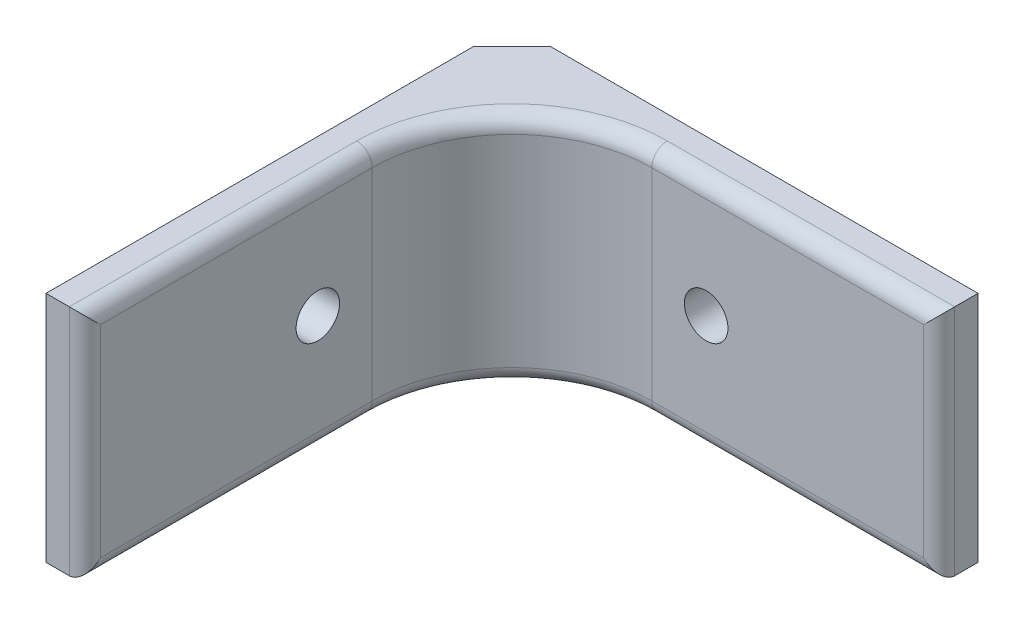
ISO-10303-21;
HEADER;
FILE_DESCRIPTION(('STEP AP214'),'2;1');
FILE_NAME('part.step','',(''),(''),'','','');
FILE_SCHEMA(('AUTOMOTIVE_DESIGN { 1 0 10303 214 1 1 1 1 }'));
ENDSEC;
DATA;
#1=APPLICATION_CONTEXT('core data for automotive mechanical design processes');
#2=APPLICATION_PROTOCOL_DEFINITION('international standard','automotive_design',2000,#1);
#3=PRODUCT_CONTEXT('',#1,'mechanical');
#4=PRODUCT('Part','Part','',(#3));
#5=PRODUCT_RELATED_PRODUCT_CATEGORY('part','',(#4));
#6=PRODUCT_DEFINITION_FORMATION('','',#4);
#7=PRODUCT_DEFINITION_CONTEXT('part definition',#1,'design');
#8=PRODUCT_DEFINITION('design','',#6,#7);
#9=PRODUCT_DEFINITION_SHAPE('','',#8);
#10=(LENGTH_UNIT() NAMED_UNIT(*) SI_UNIT(.MILLI.,.METRE.));
#11=(NAMED_UNIT(*) PLANE_ANGLE_UNIT() SI_UNIT($,.RADIAN.));
#12=(NAMED_UNIT(*) SI_UNIT($,.STERADIAN.) SOLID_ANGLE_UNIT());
#13=UNCERTAINTY_MEASURE_WITH_UNIT(LENGTH_MEASURE(1.E-05),#10,'distance_accuracy_value','');
#14=(GEOMETRIC_REPRESENTATION_CONTEXT(3) GLOBAL_UNCERTAINTY_ASSIGNED_CONTEXT((#13)) GLOBAL_UNIT_ASSIGNED_CONTEXT((#10,
#11,#12)) REPRESENTATION_CONTEXT('',''));
#15=CARTESIAN_POINT('',(0.,0.,0.));
#16=DIRECTION('',(0.,0.,1.));
#17=DIRECTION('',(1.,0.,0.));
#18=AXIS2_PLACEMENT_3D('',#15,#16,#17);
#19=CARTESIAN_POINT('',(0.,38.1,0.));
#20=DIRECTION('',(0.,0.,1.));
#21=DIRECTION('',(1.,0.,0.));
#22=AXIS2_PLACEMENT_3D('',#19,#20,#21);
#23=PLANE('',#22);
#24=CARTESIAN_POINT('',(38.1,19.05,0.));
#25=DIRECTION('',(0.,0.,1.));
#26=DIRECTION('',(1.,0.,0.));
#27=AXIS2_PLACEMENT_3D('',#24,#25,#26);
#28=CIRCLE('',#27,3.556);
#29=CARTESIAN_POINT('',(41.656,19.05,0.));
#30=VERTEX_POINT('',#29);
#31=EDGE_CURVE('E279',#30,#30,#28,.T.);
#32=ORIENTED_EDGE('',*,*,#31,.T.);
#33=EDGE_LOOP('',(#32));
#34=FACE_BOUND('',#33,.T.);
#35=DIRECTION('',(-1.,0.,0.));
#36=VECTOR('',#35,1.);
#37=CARTESIAN_POINT('',(0.,0.,0.));
#38=LINE('',#37,#36);
#39=CARTESIAN_POINT('',(76.2,0.,0.));
#40=VERTEX_POINT('',#39);
#41=CARTESIAN_POINT('',(6.35000000000004,0.,0.));
#42=VERTEX_POINT('',#41);
#43=EDGE_CURVE('E165',#40,#42,#38,.T.);
#44=ORIENTED_EDGE('',*,*,#43,.T.);
#45=DIRECTION('',(0.,1.,0.));
#46=VECTOR('',#45,1.);
#47=CARTESIAN_POINT('',(6.35000000000004,38.1,0.));
#48=LINE('',#47,#46);
#49=CARTESIAN_POINT('',(6.35000000000004,38.1,0.));
#50=VERTEX_POINT('',#49);
#51=EDGE_CURVE('E54',#42,#50,#48,.T.);
#52=ORIENTED_EDGE('',*,*,#51,.T.);
#53=DIRECTION('',(-1.,0.,0.));
#54=VECTOR('',#53,1.);
#55=CARTESIAN_POINT('',(0.,38.1,0.));
#56=LINE('',#55,#54);
#57=CARTESIAN_POINT('',(76.2,38.1,0.));
#58=VERTEX_POINT('',#57);
#59=EDGE_CURVE('E145',#58,#50,#56,.T.);
#60=ORIENTED_EDGE('',*,*,#59,.F.);
#61=DIRECTION('',(0.,-1.,0.));
#62=VECTOR('',#61,1.);
#63=CARTESIAN_POINT('',(76.2,38.1,0.));
#64=LINE('',#63,#62);
#65=EDGE_CURVE('E155',#58,#40,#64,.T.);
#66=ORIENTED_EDGE('',*,*,#65,.T.);
#67=EDGE_LOOP('',(#44,#52,#60,#66));
#68=FACE_BOUND('',#67,.T.);
#69=ADVANCED_FACE('F45',(#34,#68),#23,.F.);
#70=CARTESIAN_POINT('',(0.,38.1,0.));
#71=DIRECTION('',(1.,0.,0.));
#72=DIRECTION('',(0.,0.,-1.));
#73=AXIS2_PLACEMENT_3D('',#70,#71,#72);
#74=PLANE('',#73);
#75=CARTESIAN_POINT('',(0.,19.05,38.1));
#76=DIRECTION('',(1.,0.,0.));
#77=DIRECTION('',(0.,0.,-1.));
#78=AXIS2_PLACEMENT_3D('',#75,#76,#77);
#79=CIRCLE('',#78,3.556);
#80=CARTESIAN_POINT('',(0.,19.05,34.544));
#81=VERTEX_POINT('',#80);
#82=EDGE_CURVE('E167',#81,#81,#79,.T.);
#83=ORIENTED_EDGE('',*,*,#82,.T.);
#84=EDGE_LOOP('',(#83));
#85=FACE_BOUND('',#84,.T.);
#86=DIRECTION('',(0.,0.,1.));
#87=VECTOR('',#86,1.);
#88=CARTESIAN_POINT('',(0.,38.1,0.));
#89=LINE('',#88,#87);
#90=CARTESIAN_POINT('',(0.,38.1,6.35000000000001));
#91=VERTEX_POINT('',#90);
#92=CARTESIAN_POINT('',(0.,38.1,76.2));
#93=VERTEX_POINT('',#92);
#94=EDGE_CURVE('E135',#91,#93,#89,.T.);
#95=ORIENTED_EDGE('',*,*,#94,.F.);
#96=DIRECTION('',(0.,-1.,0.));
#97=VECTOR('',#96,1.);
#98=CARTESIAN_POINT('',(0.,38.1,6.35000000000001));
#99=LINE('',#98,#97);
#100=CARTESIAN_POINT('',(0.,0.,6.35000000000001));
#101=VERTEX_POINT('',#100);
#102=EDGE_CURVE('E213',#91,#101,#99,.T.);
#103=ORIENTED_EDGE('',*,*,#102,.T.);
#104=DIRECTION('',(0.,0.,1.));
#105=VECTOR('',#104,1.);
#106=CARTESIAN_POINT('',(0.,0.,0.));
#107=LINE('',#106,#105);
#108=CARTESIAN_POINT('',(0.,0.,76.2));
#109=VERTEX_POINT('',#108);
#110=EDGE_CURVE('E150',#101,#109,#107,.T.);
#111=ORIENTED_EDGE('',*,*,#110,.T.);
#112=DIRECTION('',(0.,-1.,0.));
#113=VECTOR('',#112,1.);
#114=CARTESIAN_POINT('',(0.,38.1,76.2));
#115=LINE('',#114,#113);
#116=EDGE_CURVE('E148',#93,#109,#115,.T.);
#117=ORIENTED_EDGE('',*,*,#116,.F.);
#118=EDGE_LOOP('',(#95,#103,#111,#117));
#119=FACE_BOUND('',#118,.T.);
#120=ADVANCED_FACE('F149',(#85,#119),#74,.F.);
#121=CARTESIAN_POINT('',(0.,38.1,76.2));
#122=DIRECTION('',(0.,0.,-1.));
#123=DIRECTION('',(-1.,0.,0.));
#124=AXIS2_PLACEMENT_3D('',#121,#122,#123);
#125=PLANE('',#124);
#126=DIRECTION('',(1.,0.,0.));
#127=VECTOR('',#126,1.);
#128=CARTESIAN_POINT('',(0.,0.,76.2));
#129=LINE('',#128,#127);
#130=CARTESIAN_POINT('',(3.81,0.,76.2));
#131=VERTEX_POINT('',#130);
#132=EDGE_CURVE('E169',#109,#131,#129,.T.);
#133=ORIENTED_EDGE('',*,*,#132,.T.);
#134=DIRECTION('',(0.,-1.,0.));
#135=VECTOR('',#134,1.);
#136=CARTESIAN_POINT('',(3.81,38.1,76.2));
#137=LINE('',#136,#135);
#138=CARTESIAN_POINT('',(3.81,38.1,76.2));
#139=VERTEX_POINT('',#138);
#140=EDGE_CURVE('E159',#131,#139,#137,.F.);
#141=ORIENTED_EDGE('',*,*,#140,.T.);
#142=DIRECTION('',(1.,0.,0.));
#143=VECTOR('',#142,1.);
#144=CARTESIAN_POINT('',(0.,38.1,76.2));
#145=LINE('',#144,#143);
#146=EDGE_CURVE('E139',#93,#139,#145,.T.);
#147=ORIENTED_EDGE('',*,*,#146,.F.);
#148=ORIENTED_EDGE('',*,*,#116,.T.);
#149=EDGE_LOOP('',(#133,#141,#147,#148));
#150=FACE_BOUND('',#149,.T.);
#151=ADVANCED_FACE('F157',(#150),#125,.F.);
#152=CARTESIAN_POINT('',(6.35,38.1,6.35));
#153=DIRECTION('',(-1.,0.,0.));
#154=DIRECTION('',(0.,0.,1.));
#155=AXIS2_PLACEMENT_3D('',#152,#153,#154);
#156=PLANE('',#155);
#157=CARTESIAN_POINT('',(6.35,19.05,38.1));
#158=DIRECTION('',(1.,0.,0.));
#159=DIRECTION('',(0.,0.,-1.));
#160=AXIS2_PLACEMENT_3D('',#157,#158,#159);
#161=CIRCLE('',#160,3.556);
#162=CARTESIAN_POINT('',(6.35,19.05,34.544));
#163=VERTEX_POINT('',#162);
#164=EDGE_CURVE('E276',#163,#163,#161,.T.);
#165=ORIENTED_EDGE('',*,*,#164,.F.);
#166=EDGE_LOOP('',(#165));
#167=FACE_BOUND('',#166,.T.);
#168=DIRECTION('',(0.,-1.,0.));
#169=VECTOR('',#168,1.);
#170=CARTESIAN_POINT('',(6.35,38.1,73.66));
#171=LINE('',#170,#169);
#172=CARTESIAN_POINT('',(6.35,35.56,73.66));
#173=VERTEX_POINT('',#172);
#174=CARTESIAN_POINT('',(6.35,2.54,73.66));
#175=VERTEX_POINT('',#174);
#176=EDGE_CURVE('E196',#173,#175,#171,.T.);
#177=ORIENTED_EDGE('',*,*,#176,.T.);
#178=DIRECTION('',(0.,0.,-1.));
#179=VECTOR('',#178,1.);
#180=CARTESIAN_POINT('',(6.35,2.54,29.21));
#181=LINE('',#180,#179);
#182=CARTESIAN_POINT('',(6.35,2.54,29.21));
#183=VERTEX_POINT('',#182);
#184=EDGE_CURVE('E198',#175,#183,#181,.T.);
#185=ORIENTED_EDGE('',*,*,#184,.T.);
#186=DIRECTION('',(0.,-1.,0.));
#187=VECTOR('',#186,1.);
#188=CARTESIAN_POINT('',(6.35,38.1,29.21));
#189=LINE('',#188,#187);
#190=CARTESIAN_POINT('',(6.35,35.56,29.21));
#191=VERTEX_POINT('',#190);
#192=EDGE_CURVE('E177',#183,#191,#189,.F.);
#193=ORIENTED_EDGE('',*,*,#192,.T.);
#194=DIRECTION('',(0.,0.,-1.));
#195=VECTOR('',#194,1.);
#196=CARTESIAN_POINT('',(6.35,35.56,6.35));
#197=LINE('',#196,#195);
#198=EDGE_CURVE('E194',#191,#173,#197,.F.);
#199=ORIENTED_EDGE('',*,*,#198,.T.);
#200=EDGE_LOOP('',(#177,#185,#193,#199));
#201=FACE_BOUND('',#200,.T.);
#202=ADVANCED_FACE('F253',(#167,#201),#156,.F.);
#203=CARTESIAN_POINT('',(6.35,38.1,6.35));
#204=DIRECTION('',(0.,0.,-1.));
#205=DIRECTION('',(-1.,0.,0.));
#206=AXIS2_PLACEMENT_3D('',#203,#204,#205);
#207=PLANE('',#206);
#208=DIRECTION('',(0.,-1.,0.));
#209=VECTOR('',#208,1.);
#210=CARTESIAN_POINT('',(29.21,0.,6.35));
#211=LINE('',#210,#209);
#212=CARTESIAN_POINT('',(29.21,35.56,6.35));
#213=VERTEX_POINT('',#212);
#214=CARTESIAN_POINT('',(29.21,2.54,6.35));
#215=VERTEX_POINT('',#214);
#216=EDGE_CURVE('E154',#213,#215,#211,.T.);
#217=ORIENTED_EDGE('',*,*,#216,.T.);
#218=DIRECTION('',(1.,0.,0.));
#219=VECTOR('',#218,1.);
#220=CARTESIAN_POINT('',(76.2,2.54,6.35));
#221=LINE('',#220,#219);
#222=CARTESIAN_POINT('',(73.66,2.54,6.35));
#223=VERTEX_POINT('',#222);
#224=EDGE_CURVE('E184',#215,#223,#221,.T.);
#225=ORIENTED_EDGE('',*,*,#224,.T.);
#226=DIRECTION('',(0.,-1.,0.));
#227=VECTOR('',#226,1.);
#228=CARTESIAN_POINT('',(73.66,38.1,6.35));
#229=LINE('',#228,#227);
#230=CARTESIAN_POINT('',(73.66,35.56,6.35));
#231=VERTEX_POINT('',#230);
#232=EDGE_CURVE('E180',#223,#231,#229,.F.);
#233=ORIENTED_EDGE('',*,*,#232,.T.);
#234=DIRECTION('',(1.,0.,0.));
#235=VECTOR('',#234,1.);
#236=CARTESIAN_POINT('',(6.35,35.56,6.35));
#237=LINE('',#236,#235);
#238=EDGE_CURVE('E182',#231,#213,#237,.F.);
#239=ORIENTED_EDGE('',*,*,#238,.T.);
#240=EDGE_LOOP('',(#217,#225,#233,#239));
#241=FACE_BOUND('',#240,.T.);
#242=CARTESIAN_POINT('',(38.1,19.05,6.35));
#243=DIRECTION('',(0.,0.,1.));
#244=DIRECTION('',(1.,0.,0.));
#245=AXIS2_PLACEMENT_3D('',#242,#243,#244);
#246=CIRCLE('',#245,3.556);
#247=CARTESIAN_POINT('',(41.656,19.05,6.35));
#248=VERTEX_POINT('',#247);
#249=EDGE_CURVE('E236',#248,#248,#246,.T.);
#250=ORIENTED_EDGE('',*,*,#249,.F.);
#251=EDGE_LOOP('',(#250));
#252=FACE_BOUND('',#251,.T.);
#253=ADVANCED_FACE('F295',(#241,#252),#207,.F.);
#254=CARTESIAN_POINT('',(76.2,38.1,0.));
#255=DIRECTION('',(-1.,0.,0.));
#256=DIRECTION('',(0.,0.,1.));
#257=AXIS2_PLACEMENT_3D('',#254,#255,#256);
#258=PLANE('',#257);
#259=DIRECTION('',(0.,0.,-1.));
#260=VECTOR('',#259,1.);
#261=CARTESIAN_POINT('',(76.2,38.1,0.));
#262=LINE('',#261,#260);
#263=CARTESIAN_POINT('',(76.2,38.1,3.81));
#264=VERTEX_POINT('',#263);
#265=EDGE_CURVE('E160',#264,#58,#262,.T.);
#266=ORIENTED_EDGE('',*,*,#265,.F.);
#267=DIRECTION('',(0.,-1.,0.));
#268=VECTOR('',#267,1.);
#269=CARTESIAN_POINT('',(76.2,38.1,3.81));
#270=LINE('',#269,#268);
#271=CARTESIAN_POINT('',(76.2,0.,3.81));
#272=VERTEX_POINT('',#271);
#273=EDGE_CURVE('E210',#264,#272,#270,.T.);
#274=ORIENTED_EDGE('',*,*,#273,.T.);
#275=DIRECTION('',(0.,0.,-1.));
#276=VECTOR('',#275,1.);
#277=CARTESIAN_POINT('',(76.2,0.,0.));
#278=LINE('',#277,#276);
#279=EDGE_CURVE('E171',#272,#40,#278,.T.);
#280=ORIENTED_EDGE('',*,*,#279,.T.);
#281=ORIENTED_EDGE('',*,*,#65,.F.);
#282=EDGE_LOOP('',(#266,#274,#280,#281));
#283=FACE_BOUND('',#282,.T.);
#284=ADVANCED_FACE('F273',(#283),#258,.F.);
#285=CARTESIAN_POINT('',(0.,38.1,0.));
#286=DIRECTION('',(0.,-1.,0.));
#287=DIRECTION('',(0.,0.,-1.));
#288=AXIS2_PLACEMENT_3D('',#285,#286,#287);
#289=PLANE('',#288);
#290=ORIENTED_EDGE('',*,*,#59,.T.);
#291=DIRECTION('',(0.707106781186549,0.,-0.707106781186546));
#292=VECTOR('',#291,1.);
#293=CARTESIAN_POINT('',(0.,38.1,6.35000000000001));
#294=LINE('',#293,#292);
#295=EDGE_CURVE('E11',#50,#91,#294,.F.);
#296=ORIENTED_EDGE('',*,*,#295,.T.);
#297=ORIENTED_EDGE('',*,*,#94,.T.);
#298=ORIENTED_EDGE('',*,*,#146,.T.);
#299=DIRECTION('',(0.,0.,-1.));
#300=VECTOR('',#299,1.);
#301=CARTESIAN_POINT('',(3.81,38.1,0.));
#302=LINE('',#301,#300);
#303=CARTESIAN_POINT('',(3.81,38.1,29.21));
#304=VERTEX_POINT('',#303);
#305=EDGE_CURVE('E200',#139,#304,#302,.T.);
#306=ORIENTED_EDGE('',*,*,#305,.T.);
#307=CARTESIAN_POINT('',(29.21,38.1,29.21));
#308=DIRECTION('',(0.,-1.,0.));
#309=DIRECTION('',(0.,0.,-1.));
#310=AXIS2_PLACEMENT_3D('',#307,#308,#309);
#311=CIRCLE('',#310,25.4);
#312=CARTESIAN_POINT('',(29.21,38.1,3.80999999999999));
#313=VERTEX_POINT('',#312);
#314=EDGE_CURVE('E202',#304,#313,#311,.T.);
#315=ORIENTED_EDGE('',*,*,#314,.T.);
#316=DIRECTION('',(1.,0.,0.));
#317=VECTOR('',#316,1.);
#318=CARTESIAN_POINT('',(0.,38.1,3.81));
#319=LINE('',#318,#317);
#320=EDGE_CURVE('E204',#313,#264,#319,.T.);
#321=ORIENTED_EDGE('',*,*,#320,.T.);
#322=ORIENTED_EDGE('',*,*,#265,.T.);
#323=EDGE_LOOP('',(#290,#296,#297,#298,#306,#315,#321,#322));
#324=FACE_BOUND('',#323,.T.);
#325=ADVANCED_FACE('F137',(#324),#289,.F.);
#326=CARTESIAN_POINT('',(0.,0.,0.));
#327=DIRECTION('',(0.,-1.,0.));
#328=DIRECTION('',(0.,0.,-1.));
#329=AXIS2_PLACEMENT_3D('',#326,#327,#328);
#330=PLANE('',#329);
#331=ORIENTED_EDGE('',*,*,#110,.F.);
#332=DIRECTION('',(-0.707106781186549,0.,0.707106781186546));
#333=VECTOR('',#332,1.);
#334=CARTESIAN_POINT('',(3.17500000000001,0.,3.17500000000002));
#335=LINE('',#334,#333);
#336=EDGE_CURVE('E68',#101,#42,#335,.F.);
#337=ORIENTED_EDGE('',*,*,#336,.T.);
#338=ORIENTED_EDGE('',*,*,#43,.F.);
#339=ORIENTED_EDGE('',*,*,#279,.F.);
#340=DIRECTION('',(1.,0.,0.));
#341=VECTOR('',#340,1.);
#342=CARTESIAN_POINT('',(29.21,0.,3.81));
#343=LINE('',#342,#341);
#344=CARTESIAN_POINT('',(29.21,0.,3.80999999999999));
#345=VERTEX_POINT('',#344);
#346=EDGE_CURVE('E191',#272,#345,#343,.F.);
#347=ORIENTED_EDGE('',*,*,#346,.T.);
#348=CARTESIAN_POINT('',(29.21,0.,29.21));
#349=DIRECTION('',(0.,-1.,0.));
#350=DIRECTION('',(0.,0.,-1.));
#351=AXIS2_PLACEMENT_3D('',#348,#349,#350);
#352=CIRCLE('',#351,25.4);
#353=CARTESIAN_POINT('',(3.80999999999999,0.,29.21));
#354=VERTEX_POINT('',#353);
#355=EDGE_CURVE('E187',#345,#354,#352,.F.);
#356=ORIENTED_EDGE('',*,*,#355,.T.);
#357=DIRECTION('',(0.,0.,-1.));
#358=VECTOR('',#357,1.);
#359=CARTESIAN_POINT('',(3.81,0.,76.2));
#360=LINE('',#359,#358);
#361=EDGE_CURVE('E189',#354,#131,#360,.F.);
#362=ORIENTED_EDGE('',*,*,#361,.T.);
#363=ORIENTED_EDGE('',*,*,#132,.F.);
#364=EDGE_LOOP('',(#331,#337,#338,#339,#347,#356,#362,#363));
#365=FACE_BOUND('',#364,.T.);
#366=ADVANCED_FACE('F239',(#365),#330,.T.);
#367=CARTESIAN_POINT('',(0.,19.05,38.1));
#368=DIRECTION('',(1.,0.,0.));
#369=DIRECTION('',(0.,0.,-1.));
#370=AXIS2_PLACEMENT_3D('',#367,#368,#369);
#371=CYLINDRICAL_SURFACE('',#370,3.556);
#372=ORIENTED_EDGE('',*,*,#82,.F.);
#373=EDGE_LOOP('',(#372));
#374=FACE_BOUND('',#373,.T.);
#375=ORIENTED_EDGE('',*,*,#164,.T.);
#376=EDGE_LOOP('',(#375));
#377=FACE_BOUND('',#376,.T.);
#378=ADVANCED_FACE('F291',(#374,#377),#371,.F.);
#379=CARTESIAN_POINT('',(38.1,19.05,0.));
#380=DIRECTION('',(0.,0.,1.));
#381=DIRECTION('',(1.,0.,0.));
#382=AXIS2_PLACEMENT_3D('',#379,#380,#381);
#383=CYLINDRICAL_SURFACE('',#382,3.556);
#384=ORIENTED_EDGE('',*,*,#31,.F.);
#385=EDGE_LOOP('',(#384));
#386=FACE_BOUND('',#385,.T.);
#387=ORIENTED_EDGE('',*,*,#249,.T.);
#388=EDGE_LOOP('',(#387));
#389=FACE_BOUND('',#388,.T.);
#390=ADVANCED_FACE('F288',(#386,#389),#383,.F.);
#391=CARTESIAN_POINT('',(29.21,38.1,29.21));
#392=DIRECTION('',(0.,1.,0.));
#393=DIRECTION('',(0.,0.,1.));
#394=AXIS2_PLACEMENT_3D('',#391,#392,#393);
#395=CYLINDRICAL_SURFACE('',#394,22.86);
#396=ORIENTED_EDGE('',*,*,#216,.F.);
#397=CARTESIAN_POINT('',(29.21,35.56,29.21));
#398=DIRECTION('',(0.,-1.,0.));
#399=DIRECTION('',(0.,0.,-1.));
#400=AXIS2_PLACEMENT_3D('',#397,#398,#399);
#401=CIRCLE('',#400,22.86);
#402=EDGE_CURVE('E208',#213,#191,#401,.F.);
#403=ORIENTED_EDGE('',*,*,#402,.T.);
#404=ORIENTED_EDGE('',*,*,#192,.F.);
#405=CARTESIAN_POINT('',(29.21,2.54,29.21));
#406=DIRECTION('',(0.,-1.,0.));
#407=DIRECTION('',(0.,0.,-1.));
#408=AXIS2_PLACEMENT_3D('',#405,#406,#407);
#409=CIRCLE('',#408,22.86);
#410=EDGE_CURVE('E206',#183,#215,#409,.T.);
#411=ORIENTED_EDGE('',*,*,#410,.T.);
#412=EDGE_LOOP('',(#396,#403,#404,#411));
#413=FACE_BOUND('',#412,.T.);
#414=ADVANCED_FACE('F257',(#413),#395,.F.);
#415=CARTESIAN_POINT('',(3.81,35.56,0.));
#416=DIRECTION('',(0.,0.,-1.));
#417=DIRECTION('',(-1.,0.,0.));
#418=AXIS2_PLACEMENT_3D('',#415,#416,#417);
#419=CYLINDRICAL_SURFACE('',#418,2.54);
#420=CARTESIAN_POINT('',(3.81,35.56,29.21));
#421=DIRECTION('',(0.,0.,-1.));
#422=DIRECTION('',(-1.,0.,0.));
#423=AXIS2_PLACEMENT_3D('',#420,#421,#422);
#424=CIRCLE('',#423,2.54);
#425=EDGE_CURVE('E230',#304,#191,#424,.T.);
#426=ORIENTED_EDGE('',*,*,#425,.F.);
#427=ORIENTED_EDGE('',*,*,#305,.F.);
#428=CARTESIAN_POINT('',(3.81,35.56,73.66));
#429=DIRECTION('',(0.,0.707106781186547,-0.707106781186547));
#430=DIRECTION('',(0.,-0.707106781186547,-0.707106781186547));
#431=AXIS2_PLACEMENT_3D('',#428,#429,#430);
#432=ELLIPSE('',#431,3.59210244842766,2.54);
#433=EDGE_CURVE('E233',#173,#139,#432,.F.);
#434=ORIENTED_EDGE('',*,*,#433,.F.);
#435=ORIENTED_EDGE('',*,*,#198,.F.);
#436=EDGE_LOOP('',(#426,#427,#434,#435));
#437=FACE_BOUND('',#436,.T.);
#438=ADVANCED_FACE('F318',(#437),#419,.T.);
#439=CARTESIAN_POINT('',(3.81,38.1,73.66));
#440=DIRECTION('',(0.,-1.,0.));
#441=DIRECTION('',(0.,0.,-1.));
#442=AXIS2_PLACEMENT_3D('',#439,#440,#441);
#443=CYLINDRICAL_SURFACE('',#442,2.54);
#444=ORIENTED_EDGE('',*,*,#433,.T.);
#445=ORIENTED_EDGE('',*,*,#140,.F.);
#446=CARTESIAN_POINT('',(3.81,2.54,73.66));
#447=DIRECTION('',(0.,-0.707106781186547,-0.707106781186547));
#448=DIRECTION('',(0.,-0.707106781186547,0.707106781186547));
#449=AXIS2_PLACEMENT_3D('',#446,#447,#448);
#450=ELLIPSE('',#449,3.59210244842766,2.54);
#451=EDGE_CURVE('E227',#175,#131,#450,.T.);
#452=ORIENTED_EDGE('',*,*,#451,.F.);
#453=ORIENTED_EDGE('',*,*,#176,.F.);
#454=EDGE_LOOP('',(#444,#445,#452,#453));
#455=FACE_BOUND('',#454,.T.);
#456=ADVANCED_FACE('F243',(#455),#443,.T.);
#457=CARTESIAN_POINT('',(29.21,35.56,29.21));
#458=DIRECTION('',(0.,-1.,0.));
#459=DIRECTION('',(0.,0.,-1.));
#460=AXIS2_PLACEMENT_3D('',#457,#458,#459);
#461=TOROIDAL_SURFACE('',#460,25.4,2.54);
#462=ORIENTED_EDGE('',*,*,#425,.T.);
#463=ORIENTED_EDGE('',*,*,#402,.F.);
#464=CARTESIAN_POINT('',(29.21,35.56,3.80999999999999));
#465=DIRECTION('',(1.,0.,0.));
#466=DIRECTION('',(0.,0.,-1.));
#467=AXIS2_PLACEMENT_3D('',#464,#465,#466);
#468=CIRCLE('',#467,2.54);
#469=EDGE_CURVE('E224',#313,#213,#468,.T.);
#470=ORIENTED_EDGE('',*,*,#469,.F.);
#471=ORIENTED_EDGE('',*,*,#314,.F.);
#472=EDGE_LOOP('',(#462,#463,#470,#471));
#473=FACE_BOUND('',#472,.T.);
#474=ADVANCED_FACE('F261',(#473),#461,.T.);
#475=CARTESIAN_POINT('',(3.81,2.54,6.35));
#476=DIRECTION('',(0.,0.,1.));
#477=DIRECTION('',(1.,0.,0.));
#478=AXIS2_PLACEMENT_3D('',#475,#476,#477);
#479=CYLINDRICAL_SURFACE('',#478,2.54);
#480=ORIENTED_EDGE('',*,*,#451,.T.);
#481=ORIENTED_EDGE('',*,*,#361,.F.);
#482=CARTESIAN_POINT('',(3.81,2.54,29.21));
#483=DIRECTION('',(0.,0.,-1.));
#484=DIRECTION('',(-1.,0.,0.));
#485=AXIS2_PLACEMENT_3D('',#482,#483,#484);
#486=CIRCLE('',#485,2.54);
#487=EDGE_CURVE('E221',#183,#354,#486,.T.);
#488=ORIENTED_EDGE('',*,*,#487,.F.);
#489=ORIENTED_EDGE('',*,*,#184,.F.);
#490=EDGE_LOOP('',(#480,#481,#488,#489));
#491=FACE_BOUND('',#490,.T.);
#492=ADVANCED_FACE('F248',(#491),#479,.T.);
#493=CARTESIAN_POINT('',(0.,35.56,3.81));
#494=DIRECTION('',(1.,0.,0.));
#495=DIRECTION('',(0.,0.,-1.));
#496=AXIS2_PLACEMENT_3D('',#493,#494,#495);
#497=CYLINDRICAL_SURFACE('',#496,2.54);
#498=ORIENTED_EDGE('',*,*,#469,.T.);
#499=ORIENTED_EDGE('',*,*,#238,.F.);
#500=CARTESIAN_POINT('',(73.66,35.56,3.81));
#501=DIRECTION('',(0.707106781186547,-0.707106781186547,0.));
#502=DIRECTION('',(-0.707106781186547,-0.707106781186547,0.));
#503=AXIS2_PLACEMENT_3D('',#500,#501,#502);
#504=ELLIPSE('',#503,3.59210244842766,2.54);
#505=EDGE_CURVE('E218',#264,#231,#504,.T.);
#506=ORIENTED_EDGE('',*,*,#505,.F.);
#507=ORIENTED_EDGE('',*,*,#320,.F.);
#508=EDGE_LOOP('',(#498,#499,#506,#507));
#509=FACE_BOUND('',#508,.T.);
#510=ADVANCED_FACE('F267',(#509),#497,.T.);
#511=CARTESIAN_POINT('',(29.21,2.54,29.21));
#512=DIRECTION('',(0.,-1.,0.));
#513=DIRECTION('',(0.,0.,-1.));
#514=AXIS2_PLACEMENT_3D('',#511,#512,#513);
#515=TOROIDAL_SURFACE('',#514,25.4,2.54);
#516=ORIENTED_EDGE('',*,*,#487,.T.);
#517=ORIENTED_EDGE('',*,*,#355,.F.);
#518=CARTESIAN_POINT('',(29.21,2.54,3.80999999999999));
#519=DIRECTION('',(1.,0.,0.));
#520=DIRECTION('',(0.,0.,-1.));
#521=AXIS2_PLACEMENT_3D('',#518,#519,#520);
#522=CIRCLE('',#521,2.54);
#523=EDGE_CURVE('E216',#215,#345,#522,.T.);
#524=ORIENTED_EDGE('',*,*,#523,.F.);
#525=ORIENTED_EDGE('',*,*,#410,.F.);
#526=EDGE_LOOP('',(#516,#517,#524,#525));
#527=FACE_BOUND('',#526,.T.);
#528=ADVANCED_FACE('F325',(#527),#515,.T.);
#529=CARTESIAN_POINT('',(73.66,38.1,3.81));
#530=DIRECTION('',(0.,-1.,0.));
#531=DIRECTION('',(0.,0.,-1.));
#532=AXIS2_PLACEMENT_3D('',#529,#530,#531);
#533=CYLINDRICAL_SURFACE('',#532,2.54);
#534=ORIENTED_EDGE('',*,*,#505,.T.);
#535=ORIENTED_EDGE('',*,*,#232,.F.);
#536=CARTESIAN_POINT('',(73.66,2.54,3.81));
#537=DIRECTION('',(-0.707106781186547,-0.707106781186547,0.));
#538=DIRECTION('',(0.707106781186547,-0.707106781186547,0.));
#539=AXIS2_PLACEMENT_3D('',#536,#537,#538);
#540=ELLIPSE('',#539,3.59210244842766,2.54);
#541=EDGE_CURVE('E214',#272,#223,#540,.T.);
#542=ORIENTED_EDGE('',*,*,#541,.F.);
#543=ORIENTED_EDGE('',*,*,#273,.F.);
#544=EDGE_LOOP('',(#534,#535,#542,#543));
#545=FACE_BOUND('',#544,.T.);
#546=ADVANCED_FACE('F321',(#545),#533,.T.);
#547=CARTESIAN_POINT('',(6.35,2.54,3.81));
#548=DIRECTION('',(-1.,0.,0.));
#549=DIRECTION('',(0.,0.,1.));
#550=AXIS2_PLACEMENT_3D('',#547,#548,#549);
#551=CYLINDRICAL_SURFACE('',#550,2.54);
#552=ORIENTED_EDGE('',*,*,#523,.T.);
#553=ORIENTED_EDGE('',*,*,#346,.F.);
#554=ORIENTED_EDGE('',*,*,#541,.T.);
#555=ORIENTED_EDGE('',*,*,#224,.F.);
#556=EDGE_LOOP('',(#552,#553,#554,#555));
#557=FACE_BOUND('',#556,.T.);
#558=ADVANCED_FACE('F319',(#557),#551,.T.);
#559=CARTESIAN_POINT('',(0.,38.1,6.35000000000001));
#560=DIRECTION('',(0.707106781186546,0.,0.707106781186549));
#561=DIRECTION('',(0.,-1.,0.));
#562=AXIS2_PLACEMENT_3D('',#559,#560,#561);
#563=PLANE('',#562);
#564=ORIENTED_EDGE('',*,*,#295,.F.);
#565=ORIENTED_EDGE('',*,*,#51,.F.);
#566=ORIENTED_EDGE('',*,*,#336,.F.);
#567=ORIENTED_EDGE('',*,*,#102,.F.);
#568=EDGE_LOOP('',(#564,#565,#566,#567));
#569=FACE_BOUND('',#568,.T.);
#570=ADVANCED_FACE('F48',(#569),#563,.F.);
#571=CLOSED_SHELL('',(#69,#120,#151,#202,#253,#284,#325,#366,#378,#390,#414,#438,#456,#474,#492,
#510,#528,#546,#558,#570));
#572=MANIFOLD_SOLID_BREP('B2',#571);
#573=ADVANCED_BREP_SHAPE_REPRESENTATION('',(#18,#572),#14);
#574=SHAPE_DEFINITION_REPRESENTATION(#9,#573);
ENDSEC;
END-ISO-10303-21;
